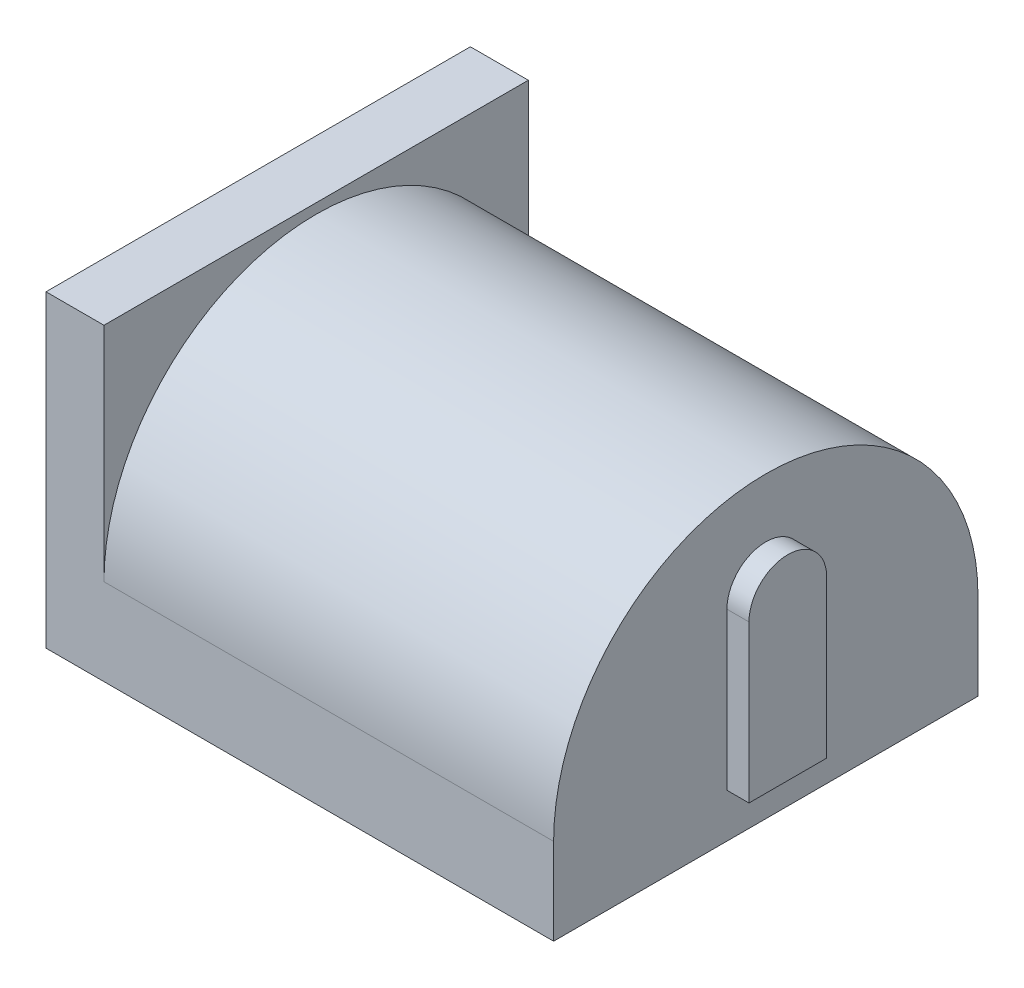
ISO-10303-21;
HEADER;
FILE_DESCRIPTION(('STEP AP214'),'2;1');
FILE_NAME('part.step','',(''),(''),'','','');
FILE_SCHEMA(('AUTOMOTIVE_DESIGN { 1 0 10303 214 1 1 1 1 }'));
ENDSEC;
DATA;
#1=APPLICATION_CONTEXT('core data for automotive mechanical design processes');
#2=APPLICATION_PROTOCOL_DEFINITION('international standard','automotive_design',2000,#1);
#3=PRODUCT_CONTEXT('',#1,'mechanical');
#4=PRODUCT('Part','Part','',(#3));
#5=PRODUCT_RELATED_PRODUCT_CATEGORY('part','',(#4));
#6=PRODUCT_DEFINITION_FORMATION('','',#4);
#7=PRODUCT_DEFINITION_CONTEXT('part definition',#1,'design');
#8=PRODUCT_DEFINITION('design','',#6,#7);
#9=PRODUCT_DEFINITION_SHAPE('','',#8);
#10=(LENGTH_UNIT() NAMED_UNIT(*) SI_UNIT(.MILLI.,.METRE.));
#11=(NAMED_UNIT(*) PLANE_ANGLE_UNIT() SI_UNIT($,.RADIAN.));
#12=(NAMED_UNIT(*) SI_UNIT($,.STERADIAN.) SOLID_ANGLE_UNIT());
#13=UNCERTAINTY_MEASURE_WITH_UNIT(LENGTH_MEASURE(1.E-05),#10,'distance_accuracy_value','');
#14=(GEOMETRIC_REPRESENTATION_CONTEXT(3) GLOBAL_UNCERTAINTY_ASSIGNED_CONTEXT((#13)) GLOBAL_UNIT_ASSIGNED_CONTEXT((#10,
#11,#12)) REPRESENTATION_CONTEXT('',''));
#15=CARTESIAN_POINT('',(0.,0.,0.));
#16=DIRECTION('',(0.,0.,1.));
#17=DIRECTION('',(1.,0.,0.));
#18=AXIS2_PLACEMENT_3D('',#15,#16,#17);
#19=CARTESIAN_POINT('',(-2.69481440356563,0.,0.));
#20=DIRECTION('',(1.,0.,0.));
#21=DIRECTION('',(0.,0.,-1.));
#22=AXIS2_PLACEMENT_3D('',#19,#20,#21);
#23=PLANE('',#22);
#24=DIRECTION('',(0.,0.,-1.));
#25=VECTOR('',#24,1.);
#26=CARTESIAN_POINT('',(-2.69481440356563,31.4681757456685,0.));
#27=LINE('',#26,#25);
#28=CARTESIAN_POINT('',(-2.69481440356563,31.4681757456685,74.0386950594776));
#29=VERTEX_POINT('',#28);
#30=CARTESIAN_POINT('',(-2.69481440356563,31.4681757456685,64.4138517805493));
#31=VERTEX_POINT('',#30);
#32=EDGE_CURVE('E152',#29,#31,#27,.T.);
#33=ORIENTED_EDGE('',*,*,#32,.T.);
#34=DIRECTION('',(0.,1.,0.));
#35=VECTOR('',#34,1.);
#36=CARTESIAN_POINT('',(-2.69481440356563,0.,64.4138517805493));
#37=LINE('',#36,#35);
#38=CARTESIAN_POINT('',(-2.69481440356563,33.4301445128062,64.4138517805493));
#39=VERTEX_POINT('',#38);
#40=EDGE_CURVE('E155',#31,#39,#37,.T.);
#41=ORIENTED_EDGE('',*,*,#40,.T.);
#42=CARTESIAN_POINT('',(-2.69481440356563,33.4301445128062,69.2262734200134));
#43=DIRECTION('',(1.,0.,0.));
#44=DIRECTION('',(0.,0.,-1.));
#45=AXIS2_PLACEMENT_3D('',#42,#43,#44);
#46=CIRCLE('',#45,4.81242163946413);
#47=CARTESIAN_POINT('',(-2.69481440356563,33.4301445128062,74.0386950594776));
#48=VERTEX_POINT('',#47);
#49=EDGE_CURVE('E157',#39,#48,#46,.T.);
#50=ORIENTED_EDGE('',*,*,#49,.T.);
#51=DIRECTION('',(0.,-1.,0.));
#52=VECTOR('',#51,1.);
#53=CARTESIAN_POINT('',(-2.69481440356563,0.,74.0386950594776));
#54=LINE('',#53,#52);
#55=EDGE_CURVE('E159',#48,#29,#54,.T.);
#56=ORIENTED_EDGE('',*,*,#55,.T.);
#57=EDGE_LOOP('',(#33,#41,#50,#56));
#58=FACE_BOUND('',#57,.T.);
#59=DIRECTION('',(0.,-1.,0.));
#60=VECTOR('',#59,1.);
#61=CARTESIAN_POINT('',(-2.69481440356563,36.0247840924796,70.1080645630315));
#62=LINE('',#61,#60);
#63=CARTESIAN_POINT('',(-2.69481440356563,36.0247840924796,70.1080645630315));
#64=VERTEX_POINT('',#63);
#65=CARTESIAN_POINT('',(-2.69481440356563,32.4681757456685,70.1080645630315));
#66=VERTEX_POINT('',#65);
#67=EDGE_CURVE('E427',#64,#66,#62,.T.);
#68=ORIENTED_EDGE('',*,*,#67,.F.);
#69=CARTESIAN_POINT('',(-2.69481440356563,36.0247840924796,69.2262734200134));
#70=DIRECTION('',(1.,0.,0.));
#71=DIRECTION('',(0.,0.,-1.));
#72=AXIS2_PLACEMENT_3D('',#69,#70,#71);
#73=CIRCLE('',#72,0.881791143018021);
#74=CARTESIAN_POINT('',(-2.69481440356563,36.0247840924796,68.3444822769954));
#75=VERTEX_POINT('',#74);
#76=EDGE_CURVE('E137',#75,#64,#73,.T.);
#77=ORIENTED_EDGE('',*,*,#76,.F.);
#78=DIRECTION('',(0.,1.,0.));
#79=VECTOR('',#78,1.);
#80=CARTESIAN_POINT('',(-2.69481440356563,32.4681757456685,68.3444822769954));
#81=LINE('',#80,#79);
#82=CARTESIAN_POINT('',(-2.69481440356563,32.4681757456685,68.3444822769954));
#83=VERTEX_POINT('',#82);
#84=EDGE_CURVE('E133',#83,#75,#81,.T.);
#85=ORIENTED_EDGE('',*,*,#84,.F.);
#86=DIRECTION('',(0.,0.,-1.));
#87=VECTOR('',#86,1.);
#88=CARTESIAN_POINT('',(-2.69481440356563,32.4681757456685,70.1080645630315));
#89=LINE('',#88,#87);
#90=EDGE_CURVE('E424',#66,#83,#89,.T.);
#91=ORIENTED_EDGE('',*,*,#90,.F.);
#92=EDGE_LOOP('',(#68,#77,#85,#91));
#93=FACE_BOUND('',#92,.T.);
#94=ADVANCED_FACE('F36',(#58,#93),#23,.T.);
#95=CARTESIAN_POINT('',(-4.20746966602503,0.,0.));
#96=DIRECTION('',(-1.,0.,0.));
#97=DIRECTION('',(0.,0.,1.));
#98=AXIS2_PLACEMENT_3D('',#95,#96,#97);
#99=PLANE('',#98);
#100=CARTESIAN_POINT('',(-4.20746966602503,35.2667652377717,69.2262734200134));
#101=DIRECTION('',(-1.,0.,0.));
#102=DIRECTION('',(0.,0.,1.));
#103=AXIS2_PLACEMENT_3D('',#100,#101,#102);
#104=CIRCLE('',#103,2.21612517076101);
#105=CARTESIAN_POINT('',(-4.20746966602503,35.2667652377717,71.4423985907745));
#106=VERTEX_POINT('',#105);
#107=EDGE_CURVE('E147',#106,#106,#104,.T.);
#108=ORIENTED_EDGE('',*,*,#107,.T.);
#109=EDGE_LOOP('',(#108));
#110=FACE_BOUND('',#109,.T.);
#111=CARTESIAN_POINT('',(-4.20746966602503,35.2667652377717,69.2262734200134));
#112=DIRECTION('',(-1.,0.,0.));
#113=DIRECTION('',(0.,0.,1.));
#114=AXIS2_PLACEMENT_3D('',#111,#112,#113);
#115=CIRCLE('',#114,0.491522535388331);
#116=CARTESIAN_POINT('',(-4.20746966602503,35.2667652377717,69.7177959554018));
#117=VERTEX_POINT('',#116);
#118=EDGE_CURVE('E139',#117,#117,#115,.T.);
#119=ORIENTED_EDGE('',*,*,#118,.F.);
#120=EDGE_LOOP('',(#119));
#121=FACE_BOUND('',#120,.T.);
#122=ADVANCED_FACE('F246',(#110,#121),#99,.T.);
#123=CARTESIAN_POINT('',(-12.8929946667427,38.4681757456685,64.4138517805493));
#124=DIRECTION('',(-1.,0.,0.));
#125=DIRECTION('',(0.,0.,1.));
#126=AXIS2_PLACEMENT_3D('',#123,#124,#125);
#127=PLANE('',#126);
#128=CARTESIAN_POINT('',(-12.8929946667427,33.4301445128062,69.2262734200134));
#129=DIRECTION('',(1.,0.,0.));
#130=DIRECTION('',(0.,0.,-1.));
#131=AXIS2_PLACEMENT_3D('',#128,#129,#130);
#132=CIRCLE('',#131,4.81242163946413);
#133=CARTESIAN_POINT('',(-12.8929946667427,33.4301445128062,64.4138517805493));
#134=VERTEX_POINT('',#133);
#135=CARTESIAN_POINT('',(-12.8929946667427,33.4301445128062,74.0386950594776));
#136=VERTEX_POINT('',#135);
#137=EDGE_CURVE('E59',#134,#136,#132,.T.);
#138=ORIENTED_EDGE('',*,*,#137,.F.);
#139=DIRECTION('',(0.,-1.,0.));
#140=VECTOR('',#139,1.);
#141=CARTESIAN_POINT('',(-12.8929946667427,38.4681757456685,64.4138517805493));
#142=LINE('',#141,#140);
#143=CARTESIAN_POINT('',(-12.8929946667427,38.4681757456685,64.4138517805493));
#144=VERTEX_POINT('',#143);
#145=EDGE_CURVE('E191',#144,#134,#142,.T.);
#146=ORIENTED_EDGE('',*,*,#145,.F.);
#147=DIRECTION('',(0.,0.,-1.));
#148=VECTOR('',#147,1.);
#149=CARTESIAN_POINT('',(-12.8929946667427,38.4681757456685,64.4138517805493));
#150=LINE('',#149,#148);
#151=CARTESIAN_POINT('',(-12.8929946667427,38.4681757456685,74.0386950594776));
#152=VERTEX_POINT('',#151);
#153=EDGE_CURVE('E206',#152,#144,#150,.T.);
#154=ORIENTED_EDGE('',*,*,#153,.F.);
#155=DIRECTION('',(0.,-1.,0.));
#156=VECTOR('',#155,1.);
#157=CARTESIAN_POINT('',(-12.8929946667427,38.4681757456685,74.0386950594776));
#158=LINE('',#157,#156);
#159=EDGE_CURVE('E170',#152,#136,#158,.T.);
#160=ORIENTED_EDGE('',*,*,#159,.T.);
#161=EDGE_LOOP('',(#138,#146,#154,#160));
#162=FACE_BOUND('',#161,.T.);
#163=ADVANCED_FACE('F232',(#162),#127,.F.);
#164=CARTESIAN_POINT('',(-14.207469666025,38.4681757456685,64.4138517805493));
#165=DIRECTION('',(1.,0.,0.));
#166=DIRECTION('',(0.,0.,-1.));
#167=AXIS2_PLACEMENT_3D('',#164,#165,#166);
#168=PLANE('',#167);
#169=CARTESIAN_POINT('',(-14.207469666025,35.2667652377717,69.2262734200134));
#170=DIRECTION('',(-1.,0.,0.));
#171=DIRECTION('',(0.,0.,1.));
#172=AXIS2_PLACEMENT_3D('',#169,#170,#171);
#173=CIRCLE('',#172,2.21612517076101);
#174=CARTESIAN_POINT('',(-14.207469666025,35.2667652377717,71.4423985907745));
#175=VERTEX_POINT('',#174);
#176=EDGE_CURVE('E142',#175,#175,#173,.T.);
#177=ORIENTED_EDGE('',*,*,#176,.F.);
#178=EDGE_LOOP('',(#177));
#179=FACE_BOUND('',#178,.T.);
#180=DIRECTION('',(0.,0.,1.));
#181=VECTOR('',#180,1.);
#182=CARTESIAN_POINT('',(-14.207469666025,31.4681757456685,64.4138517805493));
#183=LINE('',#182,#181);
#184=CARTESIAN_POINT('',(-14.207469666025,31.4681757456685,64.4138517805493));
#185=VERTEX_POINT('',#184);
#186=CARTESIAN_POINT('',(-14.207469666025,31.4681757456685,74.0386950594776));
#187=VERTEX_POINT('',#186);
#188=EDGE_CURVE('E180',#185,#187,#183,.T.);
#189=ORIENTED_EDGE('',*,*,#188,.T.);
#190=DIRECTION('',(0.,-1.,0.));
#191=VECTOR('',#190,1.);
#192=CARTESIAN_POINT('',(-14.207469666025,38.4681757456685,74.0386950594776));
#193=LINE('',#192,#191);
#194=CARTESIAN_POINT('',(-14.207469666025,38.4681757456685,74.0386950594776));
#195=VERTEX_POINT('',#194);
#196=EDGE_CURVE('E183',#195,#187,#193,.T.);
#197=ORIENTED_EDGE('',*,*,#196,.F.);
#198=DIRECTION('',(0.,0.,1.));
#199=VECTOR('',#198,1.);
#200=CARTESIAN_POINT('',(-14.207469666025,38.4681757456685,64.4138517805493));
#201=LINE('',#200,#199);
#202=CARTESIAN_POINT('',(-14.207469666025,38.4681757456685,64.4138517805493));
#203=VERTEX_POINT('',#202);
#204=EDGE_CURVE('E165',#203,#195,#201,.T.);
#205=ORIENTED_EDGE('',*,*,#204,.F.);
#206=DIRECTION('',(0.,-1.,0.));
#207=VECTOR('',#206,1.);
#208=CARTESIAN_POINT('',(-14.207469666025,38.4681757456685,64.4138517805493));
#209=LINE('',#208,#207);
#210=EDGE_CURVE('E194',#203,#185,#209,.T.);
#211=ORIENTED_EDGE('',*,*,#210,.T.);
#212=EDGE_LOOP('',(#189,#197,#205,#211));
#213=FACE_BOUND('',#212,.T.);
#214=ADVANCED_FACE('F216',(#179,#213),#168,.F.);
#215=CARTESIAN_POINT('',(-14.207469666025,38.4681757456685,74.0386950594776));
#216=DIRECTION('',(0.,0.,-1.));
#217=DIRECTION('',(-1.,0.,0.));
#218=AXIS2_PLACEMENT_3D('',#215,#216,#217);
#219=PLANE('',#218);
#220=DIRECTION('',(1.,0.,0.));
#221=VECTOR('',#220,1.);
#222=CARTESIAN_POINT('',(-14.207469666025,31.4681757456685,74.0386950594776));
#223=LINE('',#222,#221);
#224=EDGE_CURVE('E202',#187,#29,#223,.T.);
#225=ORIENTED_EDGE('',*,*,#224,.T.);
#226=ORIENTED_EDGE('',*,*,#55,.F.);
#227=DIRECTION('',(-1.,0.,0.));
#228=VECTOR('',#227,1.);
#229=CARTESIAN_POINT('',(-2.69481440356563,33.4301445128062,74.0386950594776));
#230=LINE('',#229,#228);
#231=EDGE_CURVE('E162',#48,#136,#230,.T.);
#232=ORIENTED_EDGE('',*,*,#231,.T.);
#233=ORIENTED_EDGE('',*,*,#159,.F.);
#234=DIRECTION('',(1.,0.,0.));
#235=VECTOR('',#234,1.);
#236=CARTESIAN_POINT('',(-14.207469666025,38.4681757456685,74.0386950594776));
#237=LINE('',#236,#235);
#238=EDGE_CURVE('E207',#195,#152,#237,.T.);
#239=ORIENTED_EDGE('',*,*,#238,.F.);
#240=ORIENTED_EDGE('',*,*,#196,.T.);
#241=EDGE_LOOP('',(#225,#226,#232,#233,#239,#240));
#242=FACE_BOUND('',#241,.T.);
#243=ADVANCED_FACE('F223',(#242),#219,.F.);
#244=CARTESIAN_POINT('',(-14.207469666025,38.4681757456685,64.4138517805493));
#245=DIRECTION('',(0.,0.,1.));
#246=DIRECTION('',(1.,0.,0.));
#247=AXIS2_PLACEMENT_3D('',#244,#245,#246);
#248=PLANE('',#247);
#249=DIRECTION('',(-1.,0.,0.));
#250=VECTOR('',#249,1.);
#251=CARTESIAN_POINT('',(-14.207469666025,31.4681757456685,64.4138517805493));
#252=LINE('',#251,#250);
#253=EDGE_CURVE('E200',#31,#185,#252,.T.);
#254=ORIENTED_EDGE('',*,*,#253,.T.);
#255=ORIENTED_EDGE('',*,*,#210,.F.);
#256=DIRECTION('',(-1.,0.,0.));
#257=VECTOR('',#256,1.);
#258=CARTESIAN_POINT('',(-14.207469666025,38.4681757456685,64.4138517805493));
#259=LINE('',#258,#257);
#260=EDGE_CURVE('E199',#144,#203,#259,.T.);
#261=ORIENTED_EDGE('',*,*,#260,.F.);
#262=ORIENTED_EDGE('',*,*,#145,.T.);
#263=DIRECTION('',(-1.,0.,0.));
#264=VECTOR('',#263,1.);
#265=CARTESIAN_POINT('',(-2.69481440356563,33.4301445128062,64.4138517805493));
#266=LINE('',#265,#264);
#267=EDGE_CURVE('E175',#39,#134,#266,.T.);
#268=ORIENTED_EDGE('',*,*,#267,.F.);
#269=ORIENTED_EDGE('',*,*,#40,.F.);
#270=EDGE_LOOP('',(#254,#255,#261,#262,#268,#269));
#271=FACE_BOUND('',#270,.T.);
#272=ADVANCED_FACE('F234',(#271),#248,.F.);
#273=CARTESIAN_POINT('',(0.,38.4681757456685,0.));
#274=DIRECTION('',(0.,1.,0.));
#275=DIRECTION('',(0.,0.,1.));
#276=AXIS2_PLACEMENT_3D('',#273,#274,#275);
#277=PLANE('',#276);
#278=ORIENTED_EDGE('',*,*,#204,.T.);
#279=ORIENTED_EDGE('',*,*,#238,.T.);
#280=ORIENTED_EDGE('',*,*,#153,.T.);
#281=ORIENTED_EDGE('',*,*,#260,.T.);
#282=EDGE_LOOP('',(#278,#279,#280,#281));
#283=FACE_BOUND('',#282,.T.);
#284=ADVANCED_FACE('F212',(#283),#277,.T.);
#285=CARTESIAN_POINT('',(0.,31.4681757456685,0.));
#286=DIRECTION('',(0.,1.,0.));
#287=DIRECTION('',(0.,0.,1.));
#288=AXIS2_PLACEMENT_3D('',#285,#286,#287);
#289=PLANE('',#288);
#290=ORIENTED_EDGE('',*,*,#188,.F.);
#291=ORIENTED_EDGE('',*,*,#253,.F.);
#292=ORIENTED_EDGE('',*,*,#32,.F.);
#293=ORIENTED_EDGE('',*,*,#224,.F.);
#294=EDGE_LOOP('',(#290,#291,#292,#293));
#295=FACE_BOUND('',#294,.T.);
#296=ADVANCED_FACE('F219',(#295),#289,.F.);
#297=CARTESIAN_POINT('',(-2.69481440356563,33.4301445128062,69.2262734200134));
#298=DIRECTION('',(-1.,0.,0.));
#299=DIRECTION('',(0.,0.,1.));
#300=AXIS2_PLACEMENT_3D('',#297,#298,#299);
#301=CYLINDRICAL_SURFACE('',#300,4.81242163946413);
#302=ORIENTED_EDGE('',*,*,#137,.T.);
#303=ORIENTED_EDGE('',*,*,#231,.F.);
#304=ORIENTED_EDGE('',*,*,#49,.F.);
#305=ORIENTED_EDGE('',*,*,#267,.T.);
#306=EDGE_LOOP('',(#302,#303,#304,#305));
#307=FACE_BOUND('',#306,.T.);
#308=ADVANCED_FACE('F230',(#307),#301,.T.);
#309=CARTESIAN_POINT('',(-4.20746966602503,35.2667652377717,69.2262734200134));
#310=DIRECTION('',(-1.,0.,0.));
#311=DIRECTION('',(0.,0.,1.));
#312=AXIS2_PLACEMENT_3D('',#309,#310,#311);
#313=CYLINDRICAL_SURFACE('',#312,2.21612517076101);
#314=ORIENTED_EDGE('',*,*,#107,.F.);
#315=EDGE_LOOP('',(#314));
#316=FACE_BOUND('',#315,.T.);
#317=ORIENTED_EDGE('',*,*,#176,.T.);
#318=EDGE_LOOP('',(#317));
#319=FACE_BOUND('',#318,.T.);
#320=ADVANCED_FACE('F255',(#316,#319),#313,.F.);
#321=CARTESIAN_POINT('',(-12.207469666025,35.2667652377717,69.2262734200134));
#322=DIRECTION('',(1.,0.,0.));
#323=DIRECTION('',(0.,0.,-1.));
#324=AXIS2_PLACEMENT_3D('',#321,#322,#323);
#325=CYLINDRICAL_SURFACE('',#324,0.491522535388331);
#326=CARTESIAN_POINT('',(-12.007469666025,35.2667652377717,69.2262734200134));
#327=DIRECTION('',(-1.,0.,0.));
#328=DIRECTION('',(0.,0.,1.));
#329=AXIS2_PLACEMENT_3D('',#326,#327,#328);
#330=CIRCLE('',#329,0.491522535388331);
#331=CARTESIAN_POINT('',(-12.007469666025,35.2667652377717,69.7177959554018));
#332=VERTEX_POINT('',#331);
#333=EDGE_CURVE('E11',#332,#332,#330,.F.);
#334=ORIENTED_EDGE('',*,*,#333,.T.);
#335=EDGE_LOOP('',(#334));
#336=FACE_BOUND('',#335,.T.);
#337=ORIENTED_EDGE('',*,*,#118,.T.);
#338=EDGE_LOOP('',(#337));
#339=FACE_BOUND('',#338,.T.);
#340=ADVANCED_FACE('F273',(#336,#339),#325,.T.);
#341=CARTESIAN_POINT('',(-12.207469666025,35.2667652377717,69.2262734200134));
#342=DIRECTION('',(-1.,0.,0.));
#343=DIRECTION('',(0.,0.,1.));
#344=AXIS2_PLACEMENT_3D('',#341,#342,#343);
#345=PLANE('',#344);
#346=CARTESIAN_POINT('',(-12.207469666025,35.2667652377717,69.2262734200134));
#347=DIRECTION('',(-1.,0.,0.));
#348=DIRECTION('',(0.,0.,1.));
#349=AXIS2_PLACEMENT_3D('',#346,#347,#348);
#350=CIRCLE('',#349,0.291522535388331);
#351=CARTESIAN_POINT('',(-12.207469666025,35.2667652377717,69.5177959554018));
#352=VERTEX_POINT('',#351);
#353=EDGE_CURVE('E44',#352,#352,#350,.T.);
#354=ORIENTED_EDGE('',*,*,#353,.T.);
#355=EDGE_LOOP('',(#354));
#356=FACE_BOUND('',#355,.T.);
#357=ADVANCED_FACE('F281',(#356),#345,.T.);
#358=CARTESIAN_POINT('',(-12.007469666025,35.2667652377717,69.2262734200134));
#359=DIRECTION('',(-1.,0.,0.));
#360=DIRECTION('',(0.,0.,1.));
#361=AXIS2_PLACEMENT_3D('',#358,#359,#360);
#362=TOROIDAL_SURFACE('',#361,0.291522535388331,0.2);
#363=ORIENTED_EDGE('',*,*,#333,.F.);
#364=EDGE_LOOP('',(#363));
#365=FACE_BOUND('',#364,.T.);
#366=ORIENTED_EDGE('',*,*,#353,.F.);
#367=EDGE_LOOP('',(#366));
#368=FACE_BOUND('',#367,.T.);
#369=ADVANCED_FACE('F38',(#365,#368),#362,.T.);
#370=CARTESIAN_POINT('',(-2.19481440356563,36.0247840924796,69.2262734200134));
#371=DIRECTION('',(-1.,0.,0.));
#372=DIRECTION('',(0.,0.,1.));
#373=AXIS2_PLACEMENT_3D('',#370,#371,#372);
#374=CYLINDRICAL_SURFACE('',#373,0.881791143018021);
#375=ORIENTED_EDGE('',*,*,#76,.T.);
#376=DIRECTION('',(-1.,0.,0.));
#377=VECTOR('',#376,1.);
#378=CARTESIAN_POINT('',(-2.19481440356563,36.0247840924796,70.1080645630315));
#379=LINE('',#378,#377);
#380=CARTESIAN_POINT('',(-2.19481440356563,36.0247840924796,70.1080645630315));
#381=VERTEX_POINT('',#380);
#382=EDGE_CURVE('E118',#381,#64,#379,.T.);
#383=ORIENTED_EDGE('',*,*,#382,.F.);
#384=CARTESIAN_POINT('',(-2.19481440356563,36.0247840924796,69.2262734200134));
#385=DIRECTION('',(1.,0.,0.));
#386=DIRECTION('',(0.,0.,-1.));
#387=AXIS2_PLACEMENT_3D('',#384,#385,#386);
#388=CIRCLE('',#387,0.881791143018021);
#389=CARTESIAN_POINT('',(-2.19481440356563,36.0247840924796,68.3444822769954));
#390=VERTEX_POINT('',#389);
#391=EDGE_CURVE('E125',#390,#381,#388,.T.);
#392=ORIENTED_EDGE('',*,*,#391,.F.);
#393=DIRECTION('',(-1.,0.,0.));
#394=VECTOR('',#393,1.);
#395=CARTESIAN_POINT('',(-2.19481440356563,36.0247840924796,68.3444822769954));
#396=LINE('',#395,#394);
#397=EDGE_CURVE('E422',#390,#75,#396,.T.);
#398=ORIENTED_EDGE('',*,*,#397,.T.);
#399=EDGE_LOOP('',(#375,#383,#392,#398));
#400=FACE_BOUND('',#399,.T.);
#401=ADVANCED_FACE('F135',(#400),#374,.T.);
#402=CARTESIAN_POINT('',(-2.19481440356563,36.0247840924796,70.1080645630315));
#403=DIRECTION('',(0.,0.,-1.));
#404=DIRECTION('',(-1.,0.,0.));
#405=AXIS2_PLACEMENT_3D('',#402,#403,#404);
#406=PLANE('',#405);
#407=ORIENTED_EDGE('',*,*,#67,.T.);
#408=DIRECTION('',(-1.,0.,0.));
#409=VECTOR('',#408,1.);
#410=CARTESIAN_POINT('',(-2.19481440356563,32.4681757456685,70.1080645630315));
#411=LINE('',#410,#409);
#412=CARTESIAN_POINT('',(-2.19481440356563,32.4681757456685,70.1080645630315));
#413=VERTEX_POINT('',#412);
#414=EDGE_CURVE('E121',#413,#66,#411,.T.);
#415=ORIENTED_EDGE('',*,*,#414,.F.);
#416=DIRECTION('',(0.,-1.,0.));
#417=VECTOR('',#416,1.);
#418=CARTESIAN_POINT('',(-2.19481440356563,36.0247840924796,70.1080645630315));
#419=LINE('',#418,#417);
#420=EDGE_CURVE('E114',#381,#413,#419,.T.);
#421=ORIENTED_EDGE('',*,*,#420,.F.);
#422=ORIENTED_EDGE('',*,*,#382,.T.);
#423=EDGE_LOOP('',(#407,#415,#421,#422));
#424=FACE_BOUND('',#423,.T.);
#425=ADVANCED_FACE('F116',(#424),#406,.F.);
#426=CARTESIAN_POINT('',(-2.19481440356563,32.4681757456685,70.1080645630315));
#427=DIRECTION('',(0.,1.,0.));
#428=DIRECTION('',(0.,0.,1.));
#429=AXIS2_PLACEMENT_3D('',#426,#427,#428);
#430=PLANE('',#429);
#431=ORIENTED_EDGE('',*,*,#90,.T.);
#432=DIRECTION('',(-1.,0.,0.));
#433=VECTOR('',#432,1.);
#434=CARTESIAN_POINT('',(-2.19481440356563,32.4681757456685,68.3444822769954));
#435=LINE('',#434,#433);
#436=CARTESIAN_POINT('',(-2.19481440356563,32.4681757456685,68.3444822769954));
#437=VERTEX_POINT('',#436);
#438=EDGE_CURVE('E51',#437,#83,#435,.T.);
#439=ORIENTED_EDGE('',*,*,#438,.F.);
#440=DIRECTION('',(0.,0.,-1.));
#441=VECTOR('',#440,1.);
#442=CARTESIAN_POINT('',(-2.19481440356563,32.4681757456685,70.1080645630315));
#443=LINE('',#442,#441);
#444=EDGE_CURVE('E124',#413,#437,#443,.T.);
#445=ORIENTED_EDGE('',*,*,#444,.F.);
#446=ORIENTED_EDGE('',*,*,#414,.T.);
#447=EDGE_LOOP('',(#431,#439,#445,#446));
#448=FACE_BOUND('',#447,.T.);
#449=ADVANCED_FACE('F307',(#448),#430,.F.);
#450=CARTESIAN_POINT('',(-2.19481440356563,32.4681757456685,68.3444822769954));
#451=DIRECTION('',(0.,0.,1.));
#452=DIRECTION('',(1.,0.,0.));
#453=AXIS2_PLACEMENT_3D('',#450,#451,#452);
#454=PLANE('',#453);
#455=ORIENTED_EDGE('',*,*,#84,.T.);
#456=ORIENTED_EDGE('',*,*,#397,.F.);
#457=DIRECTION('',(0.,1.,0.));
#458=VECTOR('',#457,1.);
#459=CARTESIAN_POINT('',(-2.19481440356563,32.4681757456685,68.3444822769954));
#460=LINE('',#459,#458);
#461=EDGE_CURVE('E129',#437,#390,#460,.T.);
#462=ORIENTED_EDGE('',*,*,#461,.F.);
#463=ORIENTED_EDGE('',*,*,#438,.T.);
#464=EDGE_LOOP('',(#455,#456,#462,#463));
#465=FACE_BOUND('',#464,.T.);
#466=ADVANCED_FACE('F314',(#465),#454,.F.);
#467=CARTESIAN_POINT('',(-2.19481440356563,36.0247840924796,69.2262734200134));
#468=DIRECTION('',(1.,0.,0.));
#469=DIRECTION('',(0.,0.,-1.));
#470=AXIS2_PLACEMENT_3D('',#467,#468,#469);
#471=PLANE('',#470);
#472=ORIENTED_EDGE('',*,*,#391,.T.);
#473=ORIENTED_EDGE('',*,*,#420,.T.);
#474=ORIENTED_EDGE('',*,*,#444,.T.);
#475=ORIENTED_EDGE('',*,*,#461,.T.);
#476=EDGE_LOOP('',(#472,#473,#474,#475));
#477=FACE_BOUND('',#476,.T.);
#478=ADVANCED_FACE('F128',(#477),#471,.T.);
#479=CLOSED_SHELL('',(#94,#122,#163,#214,#243,#272,#284,#296,#308,#320,#340,#357,#369,#401,#425,
#449,#466,#478));
#480=MANIFOLD_SOLID_BREP('B2',#479);
#481=ADVANCED_BREP_SHAPE_REPRESENTATION('',(#18,#480),#14);
#482=SHAPE_DEFINITION_REPRESENTATION(#9,#481);
ENDSEC;
END-ISO-10303-21;
